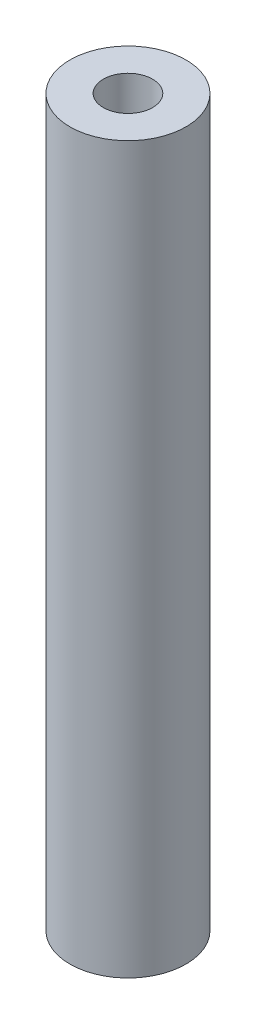
ISO-10303-21;
HEADER;
FILE_DESCRIPTION(('STEP AP214'),'2;1');
FILE_NAME('part.step','',(''),(''),'','','');
FILE_SCHEMA(('AUTOMOTIVE_DESIGN { 1 0 10303 214 1 1 1 1 }'));
ENDSEC;
DATA;
#1=APPLICATION_CONTEXT('core data for automotive mechanical design processes');
#2=APPLICATION_PROTOCOL_DEFINITION('international standard','automotive_design',2000,#1);
#3=PRODUCT_CONTEXT('',#1,'mechanical');
#4=PRODUCT('Part','Part','',(#3));
#5=PRODUCT_RELATED_PRODUCT_CATEGORY('part','',(#4));
#6=PRODUCT_DEFINITION_FORMATION('','',#4);
#7=PRODUCT_DEFINITION_CONTEXT('part definition',#1,'design');
#8=PRODUCT_DEFINITION('design','',#6,#7);
#9=PRODUCT_DEFINITION_SHAPE('','',#8);
#10=(LENGTH_UNIT() NAMED_UNIT(*) SI_UNIT(.MILLI.,.METRE.));
#11=(NAMED_UNIT(*) PLANE_ANGLE_UNIT() SI_UNIT($,.RADIAN.));
#12=(NAMED_UNIT(*) SI_UNIT($,.STERADIAN.) SOLID_ANGLE_UNIT());
#13=UNCERTAINTY_MEASURE_WITH_UNIT(LENGTH_MEASURE(1.E-05),#10,'distance_accuracy_value','');
#14=(GEOMETRIC_REPRESENTATION_CONTEXT(3) GLOBAL_UNCERTAINTY_ASSIGNED_CONTEXT((#13)) GLOBAL_UNIT_ASSIGNED_CONTEXT((#10,
#11,#12)) REPRESENTATION_CONTEXT('',''));
#15=CARTESIAN_POINT('',(0.,0.,0.));
#16=DIRECTION('',(0.,0.,1.));
#17=DIRECTION('',(1.,0.,0.));
#18=AXIS2_PLACEMENT_3D('',#15,#16,#17);
#19=CARTESIAN_POINT('',(0.,500.,0.));
#20=DIRECTION('',(0.,1.,0.));
#21=DIRECTION('',(0.,0.,1.));
#22=AXIS2_PLACEMENT_3D('',#19,#20,#21);
#23=PLANE('',#22);
#24=CARTESIAN_POINT('',(0.,500.,0.));
#25=DIRECTION('',(0.,1.,0.));
#26=DIRECTION('',(0.,0.,1.));
#27=AXIS2_PLACEMENT_3D('',#24,#25,#26);
#28=CIRCLE('',#27,40.);
#29=CARTESIAN_POINT('',(0.,500.,40.));
#30=VERTEX_POINT('',#29);
#31=EDGE_CURVE('E10',#30,#30,#28,.T.);
#32=ORIENTED_EDGE('',*,*,#31,.T.);
#33=EDGE_LOOP('',(#32));
#34=FACE_BOUND('',#33,.T.);
#35=CARTESIAN_POINT('',(0.,500.,0.));
#36=DIRECTION('',(0.,1.,0.));
#37=DIRECTION('',(0.,0.,1.));
#38=AXIS2_PLACEMENT_3D('',#35,#36,#37);
#39=CIRCLE('',#38,17.);
#40=CARTESIAN_POINT('',(0.,500.,17.));
#41=VERTEX_POINT('',#40);
#42=EDGE_CURVE('E52',#41,#41,#39,.T.);
#43=ORIENTED_EDGE('',*,*,#42,.F.);
#44=EDGE_LOOP('',(#43));
#45=FACE_BOUND('',#44,.T.);
#46=ADVANCED_FACE('F39',(#34,#45),#23,.T.);
#47=CARTESIAN_POINT('',(0.,0.,0.));
#48=DIRECTION('',(0.,1.,0.));
#49=DIRECTION('',(0.,0.,1.));
#50=AXIS2_PLACEMENT_3D('',#47,#48,#49);
#51=PLANE('',#50);
#52=CARTESIAN_POINT('',(0.,0.,0.));
#53=DIRECTION('',(0.,1.,0.));
#54=DIRECTION('',(0.,0.,1.));
#55=AXIS2_PLACEMENT_3D('',#52,#53,#54);
#56=CIRCLE('',#55,40.);
#57=CARTESIAN_POINT('',(0.,0.,40.));
#58=VERTEX_POINT('',#57);
#59=EDGE_CURVE('E43',#58,#58,#56,.T.);
#60=ORIENTED_EDGE('',*,*,#59,.F.);
#61=EDGE_LOOP('',(#60));
#62=FACE_BOUND('',#61,.T.);
#63=CARTESIAN_POINT('',(0.,0.,0.));
#64=DIRECTION('',(0.,1.,0.));
#65=DIRECTION('',(0.,0.,1.));
#66=AXIS2_PLACEMENT_3D('',#63,#64,#65);
#67=CIRCLE('',#66,17.);
#68=CARTESIAN_POINT('',(0.,0.,17.));
#69=VERTEX_POINT('',#68);
#70=EDGE_CURVE('E54',#69,#69,#67,.T.);
#71=ORIENTED_EDGE('',*,*,#70,.T.);
#72=EDGE_LOOP('',(#71));
#73=FACE_BOUND('',#72,.T.);
#74=ADVANCED_FACE('F66',(#62,#73),#51,.F.);
#75=CARTESIAN_POINT('',(0.,500.,0.));
#76=DIRECTION('',(0.,-1.,0.));
#77=DIRECTION('',(0.,0.,-1.));
#78=AXIS2_PLACEMENT_3D('',#75,#76,#77);
#79=CYLINDRICAL_SURFACE('',#78,40.);
#80=ORIENTED_EDGE('',*,*,#31,.F.);
#81=EDGE_LOOP('',(#80));
#82=FACE_BOUND('',#81,.T.);
#83=ORIENTED_EDGE('',*,*,#59,.T.);
#84=EDGE_LOOP('',(#83));
#85=FACE_BOUND('',#84,.T.);
#86=ADVANCED_FACE('F41',(#82,#85),#79,.T.);
#87=CARTESIAN_POINT('',(0.,500.,0.));
#88=DIRECTION('',(0.,-1.,0.));
#89=DIRECTION('',(0.,0.,-1.));
#90=AXIS2_PLACEMENT_3D('',#87,#88,#89);
#91=CYLINDRICAL_SURFACE('',#90,17.);
#92=ORIENTED_EDGE('',*,*,#42,.T.);
#93=EDGE_LOOP('',(#92));
#94=FACE_BOUND('',#93,.T.);
#95=ORIENTED_EDGE('',*,*,#70,.F.);
#96=EDGE_LOOP('',(#95));
#97=FACE_BOUND('',#96,.T.);
#98=ADVANCED_FACE('F62',(#94,#97),#91,.F.);
#99=CLOSED_SHELL('',(#46,#74,#86,#98));
#100=MANIFOLD_SOLID_BREP('B2',#99);
#101=ADVANCED_BREP_SHAPE_REPRESENTATION('',(#18,#100),#14);
#102=SHAPE_DEFINITION_REPRESENTATION(#9,#101);
ENDSEC;
END-ISO-10303-21;
